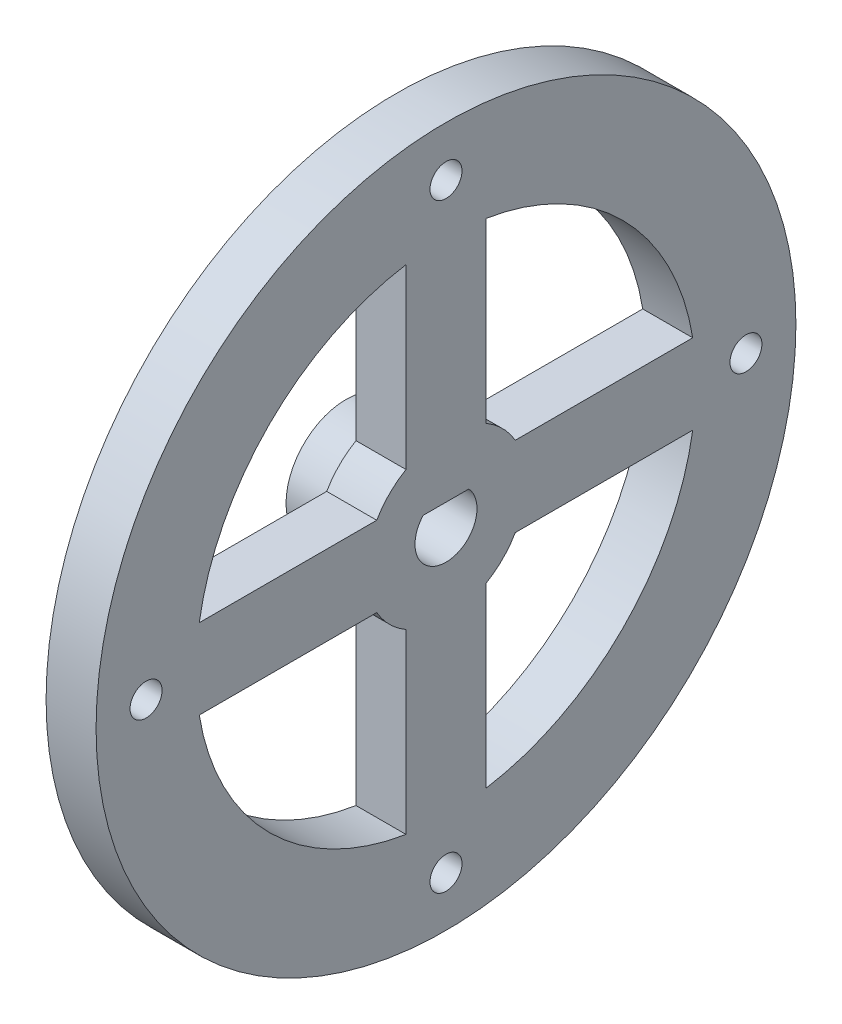
ISO-10303-21;
HEADER;
FILE_DESCRIPTION(('STEP AP214'),'2;1');
FILE_NAME('part.step','',(''),(''),'','','');
FILE_SCHEMA(('AUTOMOTIVE_DESIGN { 1 0 10303 214 1 1 1 1 }'));
ENDSEC;
DATA;
#1=APPLICATION_CONTEXT('core data for automotive mechanical design processes');
#2=APPLICATION_PROTOCOL_DEFINITION('international standard','automotive_design',2000,#1);
#3=PRODUCT_CONTEXT('',#1,'mechanical');
#4=PRODUCT('Part','Part','',(#3));
#5=PRODUCT_RELATED_PRODUCT_CATEGORY('part','',(#4));
#6=PRODUCT_DEFINITION_FORMATION('','',#4);
#7=PRODUCT_DEFINITION_CONTEXT('part definition',#1,'design');
#8=PRODUCT_DEFINITION('design','',#6,#7);
#9=PRODUCT_DEFINITION_SHAPE('','',#8);
#10=(LENGTH_UNIT() NAMED_UNIT(*) SI_UNIT(.MILLI.,.METRE.));
#11=(NAMED_UNIT(*) PLANE_ANGLE_UNIT() SI_UNIT($,.RADIAN.));
#12=(NAMED_UNIT(*) SI_UNIT($,.STERADIAN.) SOLID_ANGLE_UNIT());
#13=UNCERTAINTY_MEASURE_WITH_UNIT(LENGTH_MEASURE(1.E-05),#10,'distance_accuracy_value','');
#14=(GEOMETRIC_REPRESENTATION_CONTEXT(3) GLOBAL_UNCERTAINTY_ASSIGNED_CONTEXT((#13)) GLOBAL_UNIT_ASSIGNED_CONTEXT((#10,
#11,#12)) REPRESENTATION_CONTEXT('',''));
#15=CARTESIAN_POINT('',(0.,0.,0.));
#16=DIRECTION('',(0.,0.,1.));
#17=DIRECTION('',(1.,0.,0.));
#18=AXIS2_PLACEMENT_3D('',#15,#16,#17);
#19=CARTESIAN_POINT('',(5.,0.,-30.));
#20=DIRECTION('',(-1.,0.,0.));
#21=DIRECTION('',(0.,0.,1.));
#22=AXIS2_PLACEMENT_3D('',#19,#20,#21);
#23=CYLINDRICAL_SURFACE('',#22,1.6);
#24=CARTESIAN_POINT('',(5.,0.,-30.));
#25=DIRECTION('',(-1.,0.,0.));
#26=DIRECTION('',(0.,0.,1.));
#27=AXIS2_PLACEMENT_3D('',#24,#25,#26);
#28=CIRCLE('',#27,1.6);
#29=CARTESIAN_POINT('',(5.,0.,-28.4));
#30=VERTEX_POINT('',#29);
#31=EDGE_CURVE('E201',#30,#30,#28,.T.);
#32=ORIENTED_EDGE('',*,*,#31,.F.);
#33=EDGE_LOOP('',(#32));
#34=FACE_BOUND('',#33,.T.);
#35=CARTESIAN_POINT('',(2.,0.,-30.));
#36=DIRECTION('',(-1.,0.,0.));
#37=DIRECTION('',(0.,0.,1.));
#38=AXIS2_PLACEMENT_3D('',#35,#36,#37);
#39=CIRCLE('',#38,1.6);
#40=CARTESIAN_POINT('',(2.,0.,-28.4));
#41=VERTEX_POINT('',#40);
#42=EDGE_CURVE('E47',#41,#41,#39,.F.);
#43=ORIENTED_EDGE('',*,*,#42,.F.);
#44=EDGE_LOOP('',(#43));
#45=FACE_BOUND('',#44,.T.);
#46=ADVANCED_FACE('F43',(#34,#45),#23,.F.);
#47=CARTESIAN_POINT('',(5.,-30.,0.));
#48=DIRECTION('',(-1.,0.,0.));
#49=DIRECTION('',(0.,0.,1.));
#50=AXIS2_PLACEMENT_3D('',#47,#48,#49);
#51=CYLINDRICAL_SURFACE('',#50,1.6);
#52=CARTESIAN_POINT('',(5.,-30.,0.));
#53=DIRECTION('',(-1.,0.,0.));
#54=DIRECTION('',(0.,0.,1.));
#55=AXIS2_PLACEMENT_3D('',#52,#53,#54);
#56=CIRCLE('',#55,1.6);
#57=CARTESIAN_POINT('',(5.,-30.,1.60000000000001));
#58=VERTEX_POINT('',#57);
#59=EDGE_CURVE('E208',#58,#58,#56,.T.);
#60=ORIENTED_EDGE('',*,*,#59,.F.);
#61=EDGE_LOOP('',(#60));
#62=FACE_BOUND('',#61,.T.);
#63=CARTESIAN_POINT('',(2.,-30.,0.));
#64=DIRECTION('',(-1.,0.,0.));
#65=DIRECTION('',(0.,0.,1.));
#66=AXIS2_PLACEMENT_3D('',#63,#64,#65);
#67=CIRCLE('',#66,1.6);
#68=CARTESIAN_POINT('',(2.,-30.,1.60000000000001));
#69=VERTEX_POINT('',#68);
#70=EDGE_CURVE('E194',#69,#69,#67,.F.);
#71=ORIENTED_EDGE('',*,*,#70,.F.);
#72=EDGE_LOOP('',(#71));
#73=FACE_BOUND('',#72,.T.);
#74=ADVANCED_FACE('F350',(#62,#73),#51,.F.);
#75=CARTESIAN_POINT('',(5.,0.,30.));
#76=DIRECTION('',(-1.,0.,0.));
#77=DIRECTION('',(0.,0.,1.));
#78=AXIS2_PLACEMENT_3D('',#75,#76,#77);
#79=CYLINDRICAL_SURFACE('',#78,1.60000000000001);
#80=CARTESIAN_POINT('',(5.,0.,30.));
#81=DIRECTION('',(-1.,0.,0.));
#82=DIRECTION('',(0.,0.,1.));
#83=AXIS2_PLACEMENT_3D('',#80,#81,#82);
#84=CIRCLE('',#83,1.60000000000001);
#85=CARTESIAN_POINT('',(5.,0.,31.6));
#86=VERTEX_POINT('',#85);
#87=EDGE_CURVE('E205',#86,#86,#84,.T.);
#88=ORIENTED_EDGE('',*,*,#87,.F.);
#89=EDGE_LOOP('',(#88));
#90=FACE_BOUND('',#89,.T.);
#91=CARTESIAN_POINT('',(2.,0.,30.));
#92=DIRECTION('',(-1.,0.,0.));
#93=DIRECTION('',(0.,0.,1.));
#94=AXIS2_PLACEMENT_3D('',#91,#92,#93);
#95=CIRCLE('',#94,1.60000000000001);
#96=CARTESIAN_POINT('',(2.,0.,31.6));
#97=VERTEX_POINT('',#96);
#98=EDGE_CURVE('E342',#97,#97,#95,.F.);
#99=ORIENTED_EDGE('',*,*,#98,.F.);
#100=EDGE_LOOP('',(#99));
#101=FACE_BOUND('',#100,.T.);
#102=ADVANCED_FACE('F352',(#90,#101),#79,.F.);
#103=CARTESIAN_POINT('',(5.,30.,0.));
#104=DIRECTION('',(-1.,0.,0.));
#105=DIRECTION('',(0.,0.,1.));
#106=AXIS2_PLACEMENT_3D('',#103,#104,#105);
#107=CYLINDRICAL_SURFACE('',#106,1.6);
#108=CARTESIAN_POINT('',(5.,30.,0.));
#109=DIRECTION('',(-1.,0.,0.));
#110=DIRECTION('',(0.,0.,1.));
#111=AXIS2_PLACEMENT_3D('',#108,#109,#110);
#112=CIRCLE('',#111,1.6);
#113=CARTESIAN_POINT('',(5.,30.,1.6));
#114=VERTEX_POINT('',#113);
#115=EDGE_CURVE('E202',#114,#114,#112,.T.);
#116=ORIENTED_EDGE('',*,*,#115,.F.);
#117=EDGE_LOOP('',(#116));
#118=FACE_BOUND('',#117,.T.);
#119=CARTESIAN_POINT('',(2.,30.,0.));
#120=DIRECTION('',(-1.,0.,0.));
#121=DIRECTION('',(0.,0.,1.));
#122=AXIS2_PLACEMENT_3D('',#119,#120,#121);
#123=CIRCLE('',#122,1.6);
#124=CARTESIAN_POINT('',(2.,30.,1.6));
#125=VERTEX_POINT('',#124);
#126=EDGE_CURVE('E339',#125,#125,#123,.F.);
#127=ORIENTED_EDGE('',*,*,#126,.F.);
#128=EDGE_LOOP('',(#127));
#129=FACE_BOUND('',#128,.T.);
#130=ADVANCED_FACE('F359',(#118,#129),#107,.F.);
#131=CARTESIAN_POINT('',(0.,0.,0.));
#132=DIRECTION('',(1.,0.,0.));
#133=DIRECTION('',(0.,0.,-1.));
#134=AXIS2_PLACEMENT_3D('',#131,#132,#133);
#135=PLANE('',#134);
#136=CARTESIAN_POINT('',(0.,30.,0.));
#137=DIRECTION('',(-1.,0.,0.));
#138=DIRECTION('',(0.,0.,1.));
#139=AXIS2_PLACEMENT_3D('',#136,#137,#138);
#140=CIRCLE('',#139,4.);
#141=CARTESIAN_POINT('',(0.,30.,4.));
#142=VERTEX_POINT('',#141);
#143=EDGE_CURVE('E447',#142,#142,#140,.T.);
#144=ORIENTED_EDGE('',*,*,#143,.F.);
#145=EDGE_LOOP('',(#144));
#146=FACE_BOUND('',#145,.T.);
#147=CARTESIAN_POINT('',(0.,0.,30.));
#148=DIRECTION('',(-1.,0.,0.));
#149=DIRECTION('',(0.,0.,1.));
#150=AXIS2_PLACEMENT_3D('',#147,#148,#149);
#151=CIRCLE('',#150,4.00000000000001);
#152=CARTESIAN_POINT('',(0.,0.,34.));
#153=VERTEX_POINT('',#152);
#154=EDGE_CURVE('E451',#153,#153,#151,.T.);
#155=ORIENTED_EDGE('',*,*,#154,.F.);
#156=EDGE_LOOP('',(#155));
#157=FACE_BOUND('',#156,.T.);
#158=CARTESIAN_POINT('',(0.,-30.,0.));
#159=DIRECTION('',(-1.,0.,0.));
#160=DIRECTION('',(0.,0.,1.));
#161=AXIS2_PLACEMENT_3D('',#158,#159,#160);
#162=CIRCLE('',#161,4.);
#163=CARTESIAN_POINT('',(0.,-30.,4.));
#164=VERTEX_POINT('',#163);
#165=EDGE_CURVE('E455',#164,#164,#162,.T.);
#166=ORIENTED_EDGE('',*,*,#165,.F.);
#167=EDGE_LOOP('',(#166));
#168=FACE_BOUND('',#167,.T.);
#169=CARTESIAN_POINT('',(0.,0.,-30.));
#170=DIRECTION('',(-1.,0.,0.));
#171=DIRECTION('',(0.,0.,1.));
#172=AXIS2_PLACEMENT_3D('',#169,#170,#171);
#173=CIRCLE('',#172,4.);
#174=CARTESIAN_POINT('',(0.,0.,-26.));
#175=VERTEX_POINT('',#174);
#176=EDGE_CURVE('E459',#175,#175,#173,.T.);
#177=ORIENTED_EDGE('',*,*,#176,.F.);
#178=EDGE_LOOP('',(#177));
#179=FACE_BOUND('',#178,.T.);
#180=CARTESIAN_POINT('',(0.,0.,0.));
#181=DIRECTION('',(1.,0.,0.));
#182=DIRECTION('',(0.,0.,-1.));
#183=AXIS2_PLACEMENT_3D('',#180,#181,#182);
#184=CIRCLE('',#183,25.);
#185=CARTESIAN_POINT('',(0.,-24.6779253585061,-4.));
#186=VERTEX_POINT('',#185);
#187=CARTESIAN_POINT('',(0.,-4.00000000000001,-24.6779253585061));
#188=VERTEX_POINT('',#187);
#189=EDGE_CURVE('E68',#186,#188,#184,.T.);
#190=ORIENTED_EDGE('',*,*,#189,.T.);
#191=DIRECTION('',(0.,0.,1.));
#192=VECTOR('',#191,1.);
#193=CARTESIAN_POINT('',(0.,-4.,-6.92820323027551));
#194=LINE('',#193,#192);
#195=CARTESIAN_POINT('',(0.,-4.,-6.92820323027551));
#196=VERTEX_POINT('',#195);
#197=EDGE_CURVE('E224',#188,#196,#194,.T.);
#198=ORIENTED_EDGE('',*,*,#197,.T.);
#199=CARTESIAN_POINT('',(0.,0.,0.));
#200=DIRECTION('',(-1.,0.,0.));
#201=DIRECTION('',(0.,0.,-1.));
#202=AXIS2_PLACEMENT_3D('',#199,#200,#201);
#203=CIRCLE('',#202,8.);
#204=CARTESIAN_POINT('',(0.,-6.92820323027551,-4.));
#205=VERTEX_POINT('',#204);
#206=EDGE_CURVE('E227',#196,#205,#203,.T.);
#207=ORIENTED_EDGE('',*,*,#206,.T.);
#208=DIRECTION('',(0.,-1.,0.));
#209=VECTOR('',#208,1.);
#210=CARTESIAN_POINT('',(0.,-24.6779253585061,-4.));
#211=LINE('',#210,#209);
#212=EDGE_CURVE('E216',#205,#186,#211,.T.);
#213=ORIENTED_EDGE('',*,*,#212,.T.);
#214=EDGE_LOOP('',(#190,#198,#207,#213));
#215=FACE_BOUND('',#214,.T.);
#216=CARTESIAN_POINT('',(0.,0.,0.));
#217=DIRECTION('',(1.,0.,0.));
#218=DIRECTION('',(0.,0.,1.));
#219=AXIS2_PLACEMENT_3D('',#216,#217,#218);
#220=CIRCLE('',#219,25.);
#221=CARTESIAN_POINT('',(0.,24.6779253585061,4.));
#222=VERTEX_POINT('',#221);
#223=CARTESIAN_POINT('',(0.,4.,24.6779253585061));
#224=VERTEX_POINT('',#223);
#225=EDGE_CURVE('E269',#222,#224,#220,.T.);
#226=ORIENTED_EDGE('',*,*,#225,.T.);
#227=DIRECTION('',(0.,0.,-1.));
#228=VECTOR('',#227,1.);
#229=CARTESIAN_POINT('',(0.,4.,6.92820323027551));
#230=LINE('',#229,#228);
#231=CARTESIAN_POINT('',(0.,4.,6.92820323027551));
#232=VERTEX_POINT('',#231);
#233=EDGE_CURVE('E283',#224,#232,#230,.T.);
#234=ORIENTED_EDGE('',*,*,#233,.T.);
#235=CARTESIAN_POINT('',(0.,0.,0.));
#236=DIRECTION('',(-1.,0.,0.));
#237=DIRECTION('',(0.,0.,-1.));
#238=AXIS2_PLACEMENT_3D('',#235,#236,#237);
#239=CIRCLE('',#238,8.);
#240=CARTESIAN_POINT('',(0.,6.92820323027551,4.));
#241=VERTEX_POINT('',#240);
#242=EDGE_CURVE('E286',#232,#241,#239,.T.);
#243=ORIENTED_EDGE('',*,*,#242,.T.);
#244=DIRECTION('',(0.,1.,0.));
#245=VECTOR('',#244,1.);
#246=CARTESIAN_POINT('',(0.,24.6779253585061,4.));
#247=LINE('',#246,#245);
#248=EDGE_CURVE('E273',#241,#222,#247,.T.);
#249=ORIENTED_EDGE('',*,*,#248,.T.);
#250=EDGE_LOOP('',(#226,#234,#243,#249));
#251=FACE_BOUND('',#250,.T.);
#252=CARTESIAN_POINT('',(0.,0.,0.));
#253=DIRECTION('',(1.,0.,0.));
#254=DIRECTION('',(0.,0.,-1.));
#255=AXIS2_PLACEMENT_3D('',#252,#253,#254);
#256=CIRCLE('',#255,35.);
#257=CARTESIAN_POINT('',(0.,0.,-35.));
#258=VERTEX_POINT('',#257);
#259=EDGE_CURVE('E183',#258,#258,#256,.T.);
#260=ORIENTED_EDGE('',*,*,#259,.F.);
#261=EDGE_LOOP('',(#260));
#262=FACE_BOUND('',#261,.T.);
#263=CARTESIAN_POINT('',(0.,0.,0.));
#264=DIRECTION('',(-1.,0.,0.));
#265=DIRECTION('',(0.,0.,-1.));
#266=AXIS2_PLACEMENT_3D('',#263,#264,#265);
#267=CIRCLE('',#266,8.);
#268=CARTESIAN_POINT('',(0.,6.92820323027551,-4.));
#269=VERTEX_POINT('',#268);
#270=CARTESIAN_POINT('',(0.,4.,-6.92820323027551));
#271=VERTEX_POINT('',#270);
#272=EDGE_CURVE('E300',#269,#271,#267,.T.);
#273=ORIENTED_EDGE('',*,*,#272,.T.);
#274=DIRECTION('',(0.,0.,-1.));
#275=VECTOR('',#274,1.);
#276=CARTESIAN_POINT('',(0.,3.99999999999999,-24.6779253585061));
#277=LINE('',#276,#275);
#278=CARTESIAN_POINT('',(0.,3.99999999999999,-24.6779253585061));
#279=VERTEX_POINT('',#278);
#280=EDGE_CURVE('E314',#271,#279,#277,.T.);
#281=ORIENTED_EDGE('',*,*,#280,.T.);
#282=CARTESIAN_POINT('',(0.,0.,0.));
#283=DIRECTION('',(1.,0.,0.));
#284=DIRECTION('',(0.,0.,-1.));
#285=AXIS2_PLACEMENT_3D('',#282,#283,#284);
#286=CIRCLE('',#285,25.);
#287=CARTESIAN_POINT('',(0.,24.6779253585061,-4.));
#288=VERTEX_POINT('',#287);
#289=EDGE_CURVE('E317',#279,#288,#286,.T.);
#290=ORIENTED_EDGE('',*,*,#289,.T.);
#291=DIRECTION('',(0.,-1.,0.));
#292=VECTOR('',#291,1.);
#293=CARTESIAN_POINT('',(0.,6.92820323027551,-4.));
#294=LINE('',#293,#292);
#295=EDGE_CURVE('E304',#288,#269,#294,.T.);
#296=ORIENTED_EDGE('',*,*,#295,.T.);
#297=EDGE_LOOP('',(#273,#281,#290,#296));
#298=FACE_BOUND('',#297,.T.);
#299=CARTESIAN_POINT('',(0.,0.,0.));
#300=DIRECTION('',(1.,0.,0.));
#301=DIRECTION('',(0.,0.,-1.));
#302=AXIS2_PLACEMENT_3D('',#299,#300,#301);
#303=CIRCLE('',#302,25.);
#304=CARTESIAN_POINT('',(0.,-4.,24.6779253585061));
#305=VERTEX_POINT('',#304);
#306=CARTESIAN_POINT('',(0.,-24.6779253585061,4.));
#307=VERTEX_POINT('',#306);
#308=EDGE_CURVE('E238',#305,#307,#303,.T.);
#309=ORIENTED_EDGE('',*,*,#308,.T.);
#310=DIRECTION('',(0.,1.,0.));
#311=VECTOR('',#310,1.);
#312=CARTESIAN_POINT('',(0.,-6.92820323027551,4.));
#313=LINE('',#312,#311);
#314=CARTESIAN_POINT('',(0.,-6.92820323027551,4.));
#315=VERTEX_POINT('',#314);
#316=EDGE_CURVE('E252',#307,#315,#313,.T.);
#317=ORIENTED_EDGE('',*,*,#316,.T.);
#318=CARTESIAN_POINT('',(0.,0.,0.));
#319=DIRECTION('',(-1.,0.,0.));
#320=DIRECTION('',(0.,0.,-1.));
#321=AXIS2_PLACEMENT_3D('',#318,#319,#320);
#322=CIRCLE('',#321,8.);
#323=CARTESIAN_POINT('',(0.,-4.,6.92820323027551));
#324=VERTEX_POINT('',#323);
#325=EDGE_CURVE('E255',#315,#324,#322,.T.);
#326=ORIENTED_EDGE('',*,*,#325,.T.);
#327=DIRECTION('',(0.,0.,1.));
#328=VECTOR('',#327,1.);
#329=CARTESIAN_POINT('',(0.,-4.,24.6779253585061));
#330=LINE('',#329,#328);
#331=EDGE_CURVE('E242',#324,#305,#330,.T.);
#332=ORIENTED_EDGE('',*,*,#331,.T.);
#333=EDGE_LOOP('',(#309,#317,#326,#332));
#334=FACE_BOUND('',#333,.T.);
#335=CARTESIAN_POINT('',(0.,0.,0.));
#336=DIRECTION('',(1.,0.,0.));
#337=DIRECTION('',(0.,0.,-1.));
#338=AXIS2_PLACEMENT_3D('',#335,#336,#337);
#339=CIRCLE('',#338,6.);
#340=CARTESIAN_POINT('',(0.,0.,-6.));
#341=VERTEX_POINT('',#340);
#342=EDGE_CURVE('E11',#341,#341,#339,.F.);
#343=ORIENTED_EDGE('',*,*,#342,.F.);
#344=EDGE_LOOP('',(#343));
#345=FACE_BOUND('',#344,.T.);
#346=ADVANCED_FACE('F435',(#146,#157,#168,#179,#215,#251,#262,#298,#334,#345),#135,.F.);
#347=CARTESIAN_POINT('',(5.,0.,0.));
#348=DIRECTION('',(1.,0.,0.));
#349=DIRECTION('',(0.,0.,-1.));
#350=AXIS2_PLACEMENT_3D('',#347,#348,#349);
#351=PLANE('',#350);
#352=ORIENTED_EDGE('',*,*,#115,.T.);
#353=EDGE_LOOP('',(#352));
#354=FACE_BOUND('',#353,.T.);
#355=ORIENTED_EDGE('',*,*,#87,.T.);
#356=EDGE_LOOP('',(#355));
#357=FACE_BOUND('',#356,.T.);
#358=ORIENTED_EDGE('',*,*,#59,.T.);
#359=EDGE_LOOP('',(#358));
#360=FACE_BOUND('',#359,.T.);
#361=ORIENTED_EDGE('',*,*,#31,.T.);
#362=EDGE_LOOP('',(#361));
#363=FACE_BOUND('',#362,.T.);
#364=CARTESIAN_POINT('',(5.,0.,0.));
#365=DIRECTION('',(1.,0.,0.));
#366=DIRECTION('',(0.,0.,-1.));
#367=AXIS2_PLACEMENT_3D('',#364,#365,#366);
#368=CIRCLE('',#367,35.);
#369=CARTESIAN_POINT('',(5.,0.,-35.));
#370=VERTEX_POINT('',#369);
#371=EDGE_CURVE('E52',#370,#370,#368,.T.);
#372=ORIENTED_EDGE('',*,*,#371,.T.);
#373=EDGE_LOOP('',(#372));
#374=FACE_BOUND('',#373,.T.);
#375=DIRECTION('',(0.,0.,1.));
#376=VECTOR('',#375,1.);
#377=CARTESIAN_POINT('',(5.,2.1,2.28035085019828));
#378=LINE('',#377,#376);
#379=CARTESIAN_POINT('',(5.,2.1,-2.28035085019828));
#380=VERTEX_POINT('',#379);
#381=CARTESIAN_POINT('',(5.,2.1,2.28035085019828));
#382=VERTEX_POINT('',#381);
#383=EDGE_CURVE('E332',#380,#382,#378,.T.);
#384=ORIENTED_EDGE('',*,*,#383,.F.);
#385=CARTESIAN_POINT('',(5.,0.,0.));
#386=DIRECTION('',(1.,0.,0.));
#387=DIRECTION('',(0.,0.,-1.));
#388=AXIS2_PLACEMENT_3D('',#385,#386,#387);
#389=CIRCLE('',#388,3.1);
#390=EDGE_CURVE('E180',#382,#380,#389,.T.);
#391=ORIENTED_EDGE('',*,*,#390,.F.);
#392=EDGE_LOOP('',(#384,#391));
#393=FACE_BOUND('',#392,.T.);
#394=DIRECTION('',(0.,0.,-1.));
#395=VECTOR('',#394,1.);
#396=CARTESIAN_POINT('',(5.,3.99999999999999,-24.6779253585061));
#397=LINE('',#396,#395);
#398=CARTESIAN_POINT('',(5.,4.,-6.92820323027551));
#399=VERTEX_POINT('',#398);
#400=CARTESIAN_POINT('',(5.,3.99999999999999,-24.6779253585061));
#401=VERTEX_POINT('',#400);
#402=EDGE_CURVE('E303',#399,#401,#397,.T.);
#403=ORIENTED_EDGE('',*,*,#402,.F.);
#404=CARTESIAN_POINT('',(5.,0.,0.));
#405=DIRECTION('',(-1.,0.,0.));
#406=DIRECTION('',(0.,0.,-1.));
#407=AXIS2_PLACEMENT_3D('',#404,#405,#406);
#408=CIRCLE('',#407,8.);
#409=CARTESIAN_POINT('',(5.,6.92820323027551,-4.));
#410=VERTEX_POINT('',#409);
#411=EDGE_CURVE('E301',#410,#399,#408,.T.);
#412=ORIENTED_EDGE('',*,*,#411,.F.);
#413=DIRECTION('',(0.,-1.,0.));
#414=VECTOR('',#413,1.);
#415=CARTESIAN_POINT('',(5.,6.92820323027551,-4.));
#416=LINE('',#415,#414);
#417=CARTESIAN_POINT('',(5.,24.6779253585061,-4.));
#418=VERTEX_POINT('',#417);
#419=EDGE_CURVE('E309',#418,#410,#416,.T.);
#420=ORIENTED_EDGE('',*,*,#419,.F.);
#421=CARTESIAN_POINT('',(5.,0.,0.));
#422=DIRECTION('',(1.,0.,0.));
#423=DIRECTION('',(0.,0.,-1.));
#424=AXIS2_PLACEMENT_3D('',#421,#422,#423);
#425=CIRCLE('',#424,25.);
#426=EDGE_CURVE('E306',#401,#418,#425,.T.);
#427=ORIENTED_EDGE('',*,*,#426,.F.);
#428=EDGE_LOOP('',(#403,#412,#420,#427));
#429=FACE_BOUND('',#428,.T.);
#430=DIRECTION('',(0.,0.,-1.));
#431=VECTOR('',#430,1.);
#432=CARTESIAN_POINT('',(5.,4.,6.92820323027551));
#433=LINE('',#432,#431);
#434=CARTESIAN_POINT('',(5.,4.,24.6779253585061));
#435=VERTEX_POINT('',#434);
#436=CARTESIAN_POINT('',(5.,4.,6.92820323027551));
#437=VERTEX_POINT('',#436);
#438=EDGE_CURVE('E272',#435,#437,#433,.T.);
#439=ORIENTED_EDGE('',*,*,#438,.F.);
#440=CARTESIAN_POINT('',(5.,0.,0.));
#441=DIRECTION('',(1.,0.,0.));
#442=DIRECTION('',(0.,0.,1.));
#443=AXIS2_PLACEMENT_3D('',#440,#441,#442);
#444=CIRCLE('',#443,25.);
#445=CARTESIAN_POINT('',(5.,24.6779253585061,4.));
#446=VERTEX_POINT('',#445);
#447=EDGE_CURVE('E270',#446,#435,#444,.T.);
#448=ORIENTED_EDGE('',*,*,#447,.F.);
#449=DIRECTION('',(0.,1.,0.));
#450=VECTOR('',#449,1.);
#451=CARTESIAN_POINT('',(5.,24.6779253585061,4.));
#452=LINE('',#451,#450);
#453=CARTESIAN_POINT('',(5.,6.92820323027551,4.));
#454=VERTEX_POINT('',#453);
#455=EDGE_CURVE('E278',#454,#446,#452,.T.);
#456=ORIENTED_EDGE('',*,*,#455,.F.);
#457=CARTESIAN_POINT('',(5.,0.,0.));
#458=DIRECTION('',(-1.,0.,0.));
#459=DIRECTION('',(0.,0.,-1.));
#460=AXIS2_PLACEMENT_3D('',#457,#458,#459);
#461=CIRCLE('',#460,8.);
#462=EDGE_CURVE('E275',#437,#454,#461,.T.);
#463=ORIENTED_EDGE('',*,*,#462,.F.);
#464=EDGE_LOOP('',(#439,#448,#456,#463));
#465=FACE_BOUND('',#464,.T.);
#466=DIRECTION('',(0.,1.,0.));
#467=VECTOR('',#466,1.);
#468=CARTESIAN_POINT('',(5.,-6.92820323027551,4.));
#469=LINE('',#468,#467);
#470=CARTESIAN_POINT('',(5.,-24.6779253585061,4.));
#471=VERTEX_POINT('',#470);
#472=CARTESIAN_POINT('',(5.,-6.92820323027551,4.));
#473=VERTEX_POINT('',#472);
#474=EDGE_CURVE('E241',#471,#473,#469,.T.);
#475=ORIENTED_EDGE('',*,*,#474,.F.);
#476=CARTESIAN_POINT('',(5.,0.,0.));
#477=DIRECTION('',(1.,0.,0.));
#478=DIRECTION('',(0.,0.,-1.));
#479=AXIS2_PLACEMENT_3D('',#476,#477,#478);
#480=CIRCLE('',#479,25.);
#481=CARTESIAN_POINT('',(5.,-4.,24.6779253585061));
#482=VERTEX_POINT('',#481);
#483=EDGE_CURVE('E239',#482,#471,#480,.T.);
#484=ORIENTED_EDGE('',*,*,#483,.F.);
#485=DIRECTION('',(0.,0.,1.));
#486=VECTOR('',#485,1.);
#487=CARTESIAN_POINT('',(5.,-4.,24.6779253585061));
#488=LINE('',#487,#486);
#489=CARTESIAN_POINT('',(5.,-4.,6.92820323027551));
#490=VERTEX_POINT('',#489);
#491=EDGE_CURVE('E247',#490,#482,#488,.T.);
#492=ORIENTED_EDGE('',*,*,#491,.F.);
#493=CARTESIAN_POINT('',(5.,0.,0.));
#494=DIRECTION('',(-1.,0.,0.));
#495=DIRECTION('',(0.,0.,-1.));
#496=AXIS2_PLACEMENT_3D('',#493,#494,#495);
#497=CIRCLE('',#496,8.);
#498=EDGE_CURVE('E244',#473,#490,#497,.T.);
#499=ORIENTED_EDGE('',*,*,#498,.F.);
#500=EDGE_LOOP('',(#475,#484,#492,#499));
#501=FACE_BOUND('',#500,.T.);
#502=DIRECTION('',(0.,0.,1.));
#503=VECTOR('',#502,1.);
#504=CARTESIAN_POINT('',(5.,-4.,-6.92820323027551));
#505=LINE('',#504,#503);
#506=CARTESIAN_POINT('',(5.,-4.00000000000001,-24.6779253585061));
#507=VERTEX_POINT('',#506);
#508=CARTESIAN_POINT('',(5.,-4.,-6.92820323027551));
#509=VERTEX_POINT('',#508);
#510=EDGE_CURVE('E215',#507,#509,#505,.T.);
#511=ORIENTED_EDGE('',*,*,#510,.F.);
#512=CARTESIAN_POINT('',(5.,0.,0.));
#513=DIRECTION('',(1.,0.,0.));
#514=DIRECTION('',(0.,0.,-1.));
#515=AXIS2_PLACEMENT_3D('',#512,#513,#514);
#516=CIRCLE('',#515,25.);
#517=CARTESIAN_POINT('',(5.,-24.6779253585061,-4.));
#518=VERTEX_POINT('',#517);
#519=EDGE_CURVE('E213',#518,#507,#516,.T.);
#520=ORIENTED_EDGE('',*,*,#519,.F.);
#521=DIRECTION('',(0.,-1.,0.));
#522=VECTOR('',#521,1.);
#523=CARTESIAN_POINT('',(5.,-24.6779253585061,-4.));
#524=LINE('',#523,#522);
#525=CARTESIAN_POINT('',(5.,-6.92820323027551,-4.));
#526=VERTEX_POINT('',#525);
#527=EDGE_CURVE('E220',#526,#518,#524,.T.);
#528=ORIENTED_EDGE('',*,*,#527,.F.);
#529=CARTESIAN_POINT('',(5.,0.,0.));
#530=DIRECTION('',(-1.,0.,0.));
#531=DIRECTION('',(0.,0.,-1.));
#532=AXIS2_PLACEMENT_3D('',#529,#530,#531);
#533=CIRCLE('',#532,8.);
#534=EDGE_CURVE('E218',#509,#526,#533,.T.);
#535=ORIENTED_EDGE('',*,*,#534,.F.);
#536=EDGE_LOOP('',(#511,#520,#528,#535));
#537=FACE_BOUND('',#536,.T.);
#538=ADVANCED_FACE('F433',(#354,#357,#360,#363,#374,#393,#429,#465,#501,#537),#351,.T.);
#539=CARTESIAN_POINT('',(5.,0.,0.));
#540=DIRECTION('',(-1.,0.,0.));
#541=DIRECTION('',(0.,0.,1.));
#542=AXIS2_PLACEMENT_3D('',#539,#540,#541);
#543=CYLINDRICAL_SURFACE('',#542,35.);
#544=ORIENTED_EDGE('',*,*,#371,.F.);
#545=EDGE_LOOP('',(#544));
#546=FACE_BOUND('',#545,.T.);
#547=ORIENTED_EDGE('',*,*,#259,.T.);
#548=EDGE_LOOP('',(#547));
#549=FACE_BOUND('',#548,.T.);
#550=ADVANCED_FACE('F45',(#546,#549),#543,.T.);
#551=CARTESIAN_POINT('',(5.,0.,0.));
#552=DIRECTION('',(-1.,0.,0.));
#553=DIRECTION('',(0.,0.,1.));
#554=AXIS2_PLACEMENT_3D('',#551,#552,#553);
#555=CYLINDRICAL_SURFACE('',#554,3.1);
#556=DIRECTION('',(-1.,0.,0.));
#557=VECTOR('',#556,1.);
#558=CARTESIAN_POINT('',(5.,2.1,-2.28035085019828));
#559=LINE('',#558,#557);
#560=CARTESIAN_POINT('',(-5.,2.1,-2.28035085019828));
#561=VERTEX_POINT('',#560);
#562=EDGE_CURVE('E172',#380,#561,#559,.T.);
#563=ORIENTED_EDGE('',*,*,#562,.T.);
#564=CARTESIAN_POINT('',(-5.,0.,0.));
#565=DIRECTION('',(-1.,0.,0.));
#566=DIRECTION('',(0.,0.,1.));
#567=AXIS2_PLACEMENT_3D('',#564,#565,#566);
#568=CIRCLE('',#567,3.1);
#569=CARTESIAN_POINT('',(-5.,2.1,2.28035085019828));
#570=VERTEX_POINT('',#569);
#571=EDGE_CURVE('E177',#561,#570,#568,.T.);
#572=ORIENTED_EDGE('',*,*,#571,.T.);
#573=DIRECTION('',(-1.,0.,0.));
#574=VECTOR('',#573,1.);
#575=CARTESIAN_POINT('',(5.,2.1,2.28035085019828));
#576=LINE('',#575,#574);
#577=EDGE_CURVE('E184',#382,#570,#576,.T.);
#578=ORIENTED_EDGE('',*,*,#577,.F.);
#579=ORIENTED_EDGE('',*,*,#390,.T.);
#580=EDGE_LOOP('',(#563,#572,#578,#579));
#581=FACE_BOUND('',#580,.T.);
#582=ADVANCED_FACE('F174',(#581),#555,.F.);
#583=CARTESIAN_POINT('',(5.,2.1,2.28035085019828));
#584=DIRECTION('',(0.,-1.,0.));
#585=DIRECTION('',(0.,0.,-1.));
#586=AXIS2_PLACEMENT_3D('',#583,#584,#585);
#587=PLANE('',#586);
#588=ORIENTED_EDGE('',*,*,#577,.T.);
#589=DIRECTION('',(0.,0.,-1.));
#590=VECTOR('',#589,1.);
#591=CARTESIAN_POINT('',(-5.,2.1,-2.28035085019828));
#592=LINE('',#591,#590);
#593=EDGE_CURVE('E186',#570,#561,#592,.T.);
#594=ORIENTED_EDGE('',*,*,#593,.T.);
#595=ORIENTED_EDGE('',*,*,#562,.F.);
#596=ORIENTED_EDGE('',*,*,#383,.T.);
#597=EDGE_LOOP('',(#588,#594,#595,#596));
#598=FACE_BOUND('',#597,.T.);
#599=ADVANCED_FACE('F187',(#598),#587,.T.);
#600=CARTESIAN_POINT('',(5.,0.,0.));
#601=DIRECTION('',(-1.,0.,0.));
#602=DIRECTION('',(0.,0.,1.));
#603=AXIS2_PLACEMENT_3D('',#600,#601,#602);
#604=CYLINDRICAL_SURFACE('',#603,8.);
#605=ORIENTED_EDGE('',*,*,#272,.F.);
#606=DIRECTION('',(-1.,0.,0.));
#607=VECTOR('',#606,1.);
#608=CARTESIAN_POINT('',(5.,6.92820323027551,-4.));
#609=LINE('',#608,#607);
#610=EDGE_CURVE('E311',#410,#269,#609,.T.);
#611=ORIENTED_EDGE('',*,*,#610,.F.);
#612=ORIENTED_EDGE('',*,*,#411,.T.);
#613=DIRECTION('',(-1.,0.,0.));
#614=VECTOR('',#613,1.);
#615=CARTESIAN_POINT('',(5.,4.,-6.92820323027551));
#616=LINE('',#615,#614);
#617=EDGE_CURVE('E328',#399,#271,#616,.T.);
#618=ORIENTED_EDGE('',*,*,#617,.T.);
#619=EDGE_LOOP('',(#605,#611,#612,#618));
#620=FACE_BOUND('',#619,.T.);
#621=ADVANCED_FACE('F424',(#620),#604,.T.);
#622=CARTESIAN_POINT('',(5.,3.99999999999999,-24.6779253585061));
#623=DIRECTION('',(0.,1.,0.));
#624=DIRECTION('',(0.,0.,1.));
#625=AXIS2_PLACEMENT_3D('',#622,#623,#624);
#626=PLANE('',#625);
#627=ORIENTED_EDGE('',*,*,#280,.F.);
#628=ORIENTED_EDGE('',*,*,#617,.F.);
#629=ORIENTED_EDGE('',*,*,#402,.T.);
#630=DIRECTION('',(-1.,0.,0.));
#631=VECTOR('',#630,1.);
#632=CARTESIAN_POINT('',(5.,3.99999999999999,-24.6779253585061));
#633=LINE('',#632,#631);
#634=EDGE_CURVE('E326',#401,#279,#633,.T.);
#635=ORIENTED_EDGE('',*,*,#634,.T.);
#636=EDGE_LOOP('',(#627,#628,#629,#635));
#637=FACE_BOUND('',#636,.T.);
#638=ADVANCED_FACE('F420',(#637),#626,.T.);
#639=CARTESIAN_POINT('',(5.,0.,0.));
#640=DIRECTION('',(-1.,0.,0.));
#641=DIRECTION('',(0.,0.,1.));
#642=AXIS2_PLACEMENT_3D('',#639,#640,#641);
#643=CYLINDRICAL_SURFACE('',#642,25.);
#644=ORIENTED_EDGE('',*,*,#289,.F.);
#645=ORIENTED_EDGE('',*,*,#634,.F.);
#646=ORIENTED_EDGE('',*,*,#426,.T.);
#647=DIRECTION('',(-1.,0.,0.));
#648=VECTOR('',#647,1.);
#649=CARTESIAN_POINT('',(5.,24.6779253585061,-4.));
#650=LINE('',#649,#648);
#651=EDGE_CURVE('E324',#418,#288,#650,.T.);
#652=ORIENTED_EDGE('',*,*,#651,.T.);
#653=EDGE_LOOP('',(#644,#645,#646,#652));
#654=FACE_BOUND('',#653,.T.);
#655=ADVANCED_FACE('F416',(#654),#643,.F.);
#656=CARTESIAN_POINT('',(5.,6.92820323027551,-4.));
#657=DIRECTION('',(0.,0.,-1.));
#658=DIRECTION('',(0.,1.,0.));
#659=AXIS2_PLACEMENT_3D('',#656,#657,#658);
#660=PLANE('',#659);
#661=ORIENTED_EDGE('',*,*,#295,.F.);
#662=ORIENTED_EDGE('',*,*,#651,.F.);
#663=ORIENTED_EDGE('',*,*,#419,.T.);
#664=ORIENTED_EDGE('',*,*,#610,.T.);
#665=EDGE_LOOP('',(#661,#662,#663,#664));
#666=FACE_BOUND('',#665,.T.);
#667=ADVANCED_FACE('F412',(#666),#660,.T.);
#668=CARTESIAN_POINT('',(5.,0.,0.));
#669=DIRECTION('',(-1.,0.,0.));
#670=DIRECTION('',(0.,0.,1.));
#671=AXIS2_PLACEMENT_3D('',#668,#669,#670);
#672=CYLINDRICAL_SURFACE('',#671,25.);
#673=ORIENTED_EDGE('',*,*,#225,.F.);
#674=DIRECTION('',(-1.,0.,0.));
#675=VECTOR('',#674,1.);
#676=CARTESIAN_POINT('',(5.,24.6779253585061,4.));
#677=LINE('',#676,#675);
#678=EDGE_CURVE('E280',#446,#222,#677,.T.);
#679=ORIENTED_EDGE('',*,*,#678,.F.);
#680=ORIENTED_EDGE('',*,*,#447,.T.);
#681=DIRECTION('',(-1.,0.,0.));
#682=VECTOR('',#681,1.);
#683=CARTESIAN_POINT('',(5.,4.,24.6779253585061));
#684=LINE('',#683,#682);
#685=EDGE_CURVE('E297',#435,#224,#684,.T.);
#686=ORIENTED_EDGE('',*,*,#685,.T.);
#687=EDGE_LOOP('',(#673,#679,#680,#686));
#688=FACE_BOUND('',#687,.T.);
#689=ADVANCED_FACE('F408',(#688),#672,.F.);
#690=CARTESIAN_POINT('',(5.,4.,6.92820323027551));
#691=DIRECTION('',(0.,1.,0.));
#692=DIRECTION('',(0.,0.,1.));
#693=AXIS2_PLACEMENT_3D('',#690,#691,#692);
#694=PLANE('',#693);
#695=ORIENTED_EDGE('',*,*,#233,.F.);
#696=ORIENTED_EDGE('',*,*,#685,.F.);
#697=ORIENTED_EDGE('',*,*,#438,.T.);
#698=DIRECTION('',(-1.,0.,0.));
#699=VECTOR('',#698,1.);
#700=CARTESIAN_POINT('',(5.,4.,6.92820323027551));
#701=LINE('',#700,#699);
#702=EDGE_CURVE('E295',#437,#232,#701,.T.);
#703=ORIENTED_EDGE('',*,*,#702,.T.);
#704=EDGE_LOOP('',(#695,#696,#697,#703));
#705=FACE_BOUND('',#704,.T.);
#706=ADVANCED_FACE('F404',(#705),#694,.T.);
#707=CARTESIAN_POINT('',(5.,0.,0.));
#708=DIRECTION('',(-1.,0.,0.));
#709=DIRECTION('',(0.,0.,1.));
#710=AXIS2_PLACEMENT_3D('',#707,#708,#709);
#711=CYLINDRICAL_SURFACE('',#710,8.);
#712=ORIENTED_EDGE('',*,*,#242,.F.);
#713=ORIENTED_EDGE('',*,*,#702,.F.);
#714=ORIENTED_EDGE('',*,*,#462,.T.);
#715=DIRECTION('',(-1.,0.,0.));
#716=VECTOR('',#715,1.);
#717=CARTESIAN_POINT('',(5.,6.92820323027551,4.));
#718=LINE('',#717,#716);
#719=EDGE_CURVE('E293',#454,#241,#718,.T.);
#720=ORIENTED_EDGE('',*,*,#719,.T.);
#721=EDGE_LOOP('',(#712,#713,#714,#720));
#722=FACE_BOUND('',#721,.T.);
#723=ADVANCED_FACE('F400',(#722),#711,.T.);
#724=CARTESIAN_POINT('',(5.,24.6779253585061,4.));
#725=DIRECTION('',(0.,0.,1.));
#726=DIRECTION('',(0.,-1.,0.));
#727=AXIS2_PLACEMENT_3D('',#724,#725,#726);
#728=PLANE('',#727);
#729=ORIENTED_EDGE('',*,*,#248,.F.);
#730=ORIENTED_EDGE('',*,*,#719,.F.);
#731=ORIENTED_EDGE('',*,*,#455,.T.);
#732=ORIENTED_EDGE('',*,*,#678,.T.);
#733=EDGE_LOOP('',(#729,#730,#731,#732));
#734=FACE_BOUND('',#733,.T.);
#735=ADVANCED_FACE('F396',(#734),#728,.T.);
#736=CARTESIAN_POINT('',(5.,0.,0.));
#737=DIRECTION('',(-1.,0.,0.));
#738=DIRECTION('',(0.,0.,1.));
#739=AXIS2_PLACEMENT_3D('',#736,#737,#738);
#740=CYLINDRICAL_SURFACE('',#739,25.);
#741=ORIENTED_EDGE('',*,*,#308,.F.);
#742=DIRECTION('',(-1.,0.,0.));
#743=VECTOR('',#742,1.);
#744=CARTESIAN_POINT('',(5.,-4.,24.6779253585061));
#745=LINE('',#744,#743);
#746=EDGE_CURVE('E249',#482,#305,#745,.T.);
#747=ORIENTED_EDGE('',*,*,#746,.F.);
#748=ORIENTED_EDGE('',*,*,#483,.T.);
#749=DIRECTION('',(-1.,0.,0.));
#750=VECTOR('',#749,1.);
#751=CARTESIAN_POINT('',(5.,-24.6779253585061,4.));
#752=LINE('',#751,#750);
#753=EDGE_CURVE('E266',#471,#307,#752,.T.);
#754=ORIENTED_EDGE('',*,*,#753,.T.);
#755=EDGE_LOOP('',(#741,#747,#748,#754));
#756=FACE_BOUND('',#755,.T.);
#757=ADVANCED_FACE('F392',(#756),#740,.F.);
#758=CARTESIAN_POINT('',(5.,-6.92820323027551,4.));
#759=DIRECTION('',(0.,0.,1.));
#760=DIRECTION('',(0.,-1.,0.));
#761=AXIS2_PLACEMENT_3D('',#758,#759,#760);
#762=PLANE('',#761);
#763=ORIENTED_EDGE('',*,*,#316,.F.);
#764=ORIENTED_EDGE('',*,*,#753,.F.);
#765=ORIENTED_EDGE('',*,*,#474,.T.);
#766=DIRECTION('',(-1.,0.,0.));
#767=VECTOR('',#766,1.);
#768=CARTESIAN_POINT('',(5.,-6.92820323027551,4.));
#769=LINE('',#768,#767);
#770=EDGE_CURVE('E264',#473,#315,#769,.T.);
#771=ORIENTED_EDGE('',*,*,#770,.T.);
#772=EDGE_LOOP('',(#763,#764,#765,#771));
#773=FACE_BOUND('',#772,.T.);
#774=ADVANCED_FACE('F388',(#773),#762,.T.);
#775=CARTESIAN_POINT('',(5.,0.,0.));
#776=DIRECTION('',(-1.,0.,0.));
#777=DIRECTION('',(0.,0.,1.));
#778=AXIS2_PLACEMENT_3D('',#775,#776,#777);
#779=CYLINDRICAL_SURFACE('',#778,8.);
#780=ORIENTED_EDGE('',*,*,#325,.F.);
#781=ORIENTED_EDGE('',*,*,#770,.F.);
#782=ORIENTED_EDGE('',*,*,#498,.T.);
#783=DIRECTION('',(-1.,0.,0.));
#784=VECTOR('',#783,1.);
#785=CARTESIAN_POINT('',(5.,-4.,6.92820323027551));
#786=LINE('',#785,#784);
#787=EDGE_CURVE('E262',#490,#324,#786,.T.);
#788=ORIENTED_EDGE('',*,*,#787,.T.);
#789=EDGE_LOOP('',(#780,#781,#782,#788));
#790=FACE_BOUND('',#789,.T.);
#791=ADVANCED_FACE('F384',(#790),#779,.T.);
#792=CARTESIAN_POINT('',(5.,-4.,24.6779253585061));
#793=DIRECTION('',(0.,-1.,0.));
#794=DIRECTION('',(0.,0.,-1.));
#795=AXIS2_PLACEMENT_3D('',#792,#793,#794);
#796=PLANE('',#795);
#797=ORIENTED_EDGE('',*,*,#331,.F.);
#798=ORIENTED_EDGE('',*,*,#787,.F.);
#799=ORIENTED_EDGE('',*,*,#491,.T.);
#800=ORIENTED_EDGE('',*,*,#746,.T.);
#801=EDGE_LOOP('',(#797,#798,#799,#800));
#802=FACE_BOUND('',#801,.T.);
#803=ADVANCED_FACE('F381',(#802),#796,.T.);
#804=CARTESIAN_POINT('',(5.,0.,0.));
#805=DIRECTION('',(-1.,0.,0.));
#806=DIRECTION('',(0.,0.,1.));
#807=AXIS2_PLACEMENT_3D('',#804,#805,#806);
#808=CYLINDRICAL_SURFACE('',#807,25.);
#809=ORIENTED_EDGE('',*,*,#189,.F.);
#810=DIRECTION('',(-1.,0.,0.));
#811=VECTOR('',#810,1.);
#812=CARTESIAN_POINT('',(5.,-24.6779253585061,-4.));
#813=LINE('',#812,#811);
#814=EDGE_CURVE('E222',#518,#186,#813,.T.);
#815=ORIENTED_EDGE('',*,*,#814,.F.);
#816=ORIENTED_EDGE('',*,*,#519,.T.);
#817=DIRECTION('',(-1.,0.,0.));
#818=VECTOR('',#817,1.);
#819=CARTESIAN_POINT('',(5.,-4.00000000000001,-24.6779253585061));
#820=LINE('',#819,#818);
#821=EDGE_CURVE('E236',#507,#188,#820,.T.);
#822=ORIENTED_EDGE('',*,*,#821,.T.);
#823=EDGE_LOOP('',(#809,#815,#816,#822));
#824=FACE_BOUND('',#823,.T.);
#825=ADVANCED_FACE('F377',(#824),#808,.F.);
#826=CARTESIAN_POINT('',(5.,-4.,-6.92820323027551));
#827=DIRECTION('',(0.,-1.,0.));
#828=DIRECTION('',(0.,0.,-1.));
#829=AXIS2_PLACEMENT_3D('',#826,#827,#828);
#830=PLANE('',#829);
#831=ORIENTED_EDGE('',*,*,#197,.F.);
#832=ORIENTED_EDGE('',*,*,#821,.F.);
#833=ORIENTED_EDGE('',*,*,#510,.T.);
#834=DIRECTION('',(-1.,0.,0.));
#835=VECTOR('',#834,1.);
#836=CARTESIAN_POINT('',(5.,-4.,-6.92820323027551));
#837=LINE('',#836,#835);
#838=EDGE_CURVE('E234',#509,#196,#837,.T.);
#839=ORIENTED_EDGE('',*,*,#838,.T.);
#840=EDGE_LOOP('',(#831,#832,#833,#839));
#841=FACE_BOUND('',#840,.T.);
#842=ADVANCED_FACE('F373',(#841),#830,.T.);
#843=CARTESIAN_POINT('',(5.,0.,0.));
#844=DIRECTION('',(-1.,0.,0.));
#845=DIRECTION('',(0.,0.,1.));
#846=AXIS2_PLACEMENT_3D('',#843,#844,#845);
#847=CYLINDRICAL_SURFACE('',#846,8.);
#848=ORIENTED_EDGE('',*,*,#206,.F.);
#849=ORIENTED_EDGE('',*,*,#838,.F.);
#850=ORIENTED_EDGE('',*,*,#534,.T.);
#851=DIRECTION('',(-1.,0.,0.));
#852=VECTOR('',#851,1.);
#853=CARTESIAN_POINT('',(5.,-6.92820323027551,-4.));
#854=LINE('',#853,#852);
#855=EDGE_CURVE('E60',#526,#205,#854,.T.);
#856=ORIENTED_EDGE('',*,*,#855,.T.);
#857=EDGE_LOOP('',(#848,#849,#850,#856));
#858=FACE_BOUND('',#857,.T.);
#859=ADVANCED_FACE('F370',(#858),#847,.T.);
#860=CARTESIAN_POINT('',(5.,-24.6779253585061,-4.));
#861=DIRECTION('',(0.,0.,-1.));
#862=DIRECTION('',(0.,1.,0.));
#863=AXIS2_PLACEMENT_3D('',#860,#861,#862);
#864=PLANE('',#863);
#865=ORIENTED_EDGE('',*,*,#212,.F.);
#866=ORIENTED_EDGE('',*,*,#855,.F.);
#867=ORIENTED_EDGE('',*,*,#527,.T.);
#868=ORIENTED_EDGE('',*,*,#814,.T.);
#869=EDGE_LOOP('',(#865,#866,#867,#868));
#870=FACE_BOUND('',#869,.T.);
#871=ADVANCED_FACE('F367',(#870),#864,.T.);
#872=CARTESIAN_POINT('',(-5.,0.,0.));
#873=DIRECTION('',(-1.,0.,0.));
#874=DIRECTION('',(0.,0.,1.));
#875=AXIS2_PLACEMENT_3D('',#872,#873,#874);
#876=PLANE('',#875);
#877=CARTESIAN_POINT('',(-5.,0.,0.));
#878=DIRECTION('',(-1.,0.,0.));
#879=DIRECTION('',(0.,0.,1.));
#880=AXIS2_PLACEMENT_3D('',#877,#878,#879);
#881=CIRCLE('',#880,6.);
#882=CARTESIAN_POINT('',(-5.,0.,6.));
#883=VERTEX_POINT('',#882);
#884=EDGE_CURVE('E189',#883,#883,#881,.T.);
#885=ORIENTED_EDGE('',*,*,#884,.T.);
#886=EDGE_LOOP('',(#885));
#887=FACE_BOUND('',#886,.T.);
#888=ORIENTED_EDGE('',*,*,#593,.F.);
#889=ORIENTED_EDGE('',*,*,#571,.F.);
#890=EDGE_LOOP('',(#888,#889));
#891=FACE_BOUND('',#890,.T.);
#892=ADVANCED_FACE('F191',(#887,#891),#876,.T.);
#893=CARTESIAN_POINT('',(-5.,0.,0.));
#894=DIRECTION('',(1.,0.,0.));
#895=DIRECTION('',(0.,0.,-1.));
#896=AXIS2_PLACEMENT_3D('',#893,#894,#895);
#897=CYLINDRICAL_SURFACE('',#896,6.);
#898=ORIENTED_EDGE('',*,*,#884,.F.);
#899=EDGE_LOOP('',(#898));
#900=FACE_BOUND('',#899,.T.);
#901=ORIENTED_EDGE('',*,*,#342,.T.);
#902=EDGE_LOOP('',(#901));
#903=FACE_BOUND('',#902,.T.);
#904=ADVANCED_FACE('F468',(#900,#903),#897,.T.);
#905=CARTESIAN_POINT('',(2.,30.,0.));
#906=DIRECTION('',(-1.,0.,0.));
#907=DIRECTION('',(0.,0.,1.));
#908=AXIS2_PLACEMENT_3D('',#905,#906,#907);
#909=PLANE('',#908);
#910=CARTESIAN_POINT('',(2.,30.,0.));
#911=DIRECTION('',(-1.,0.,0.));
#912=DIRECTION('',(0.,0.,1.));
#913=AXIS2_PLACEMENT_3D('',#910,#911,#912);
#914=CIRCLE('',#913,4.);
#915=CARTESIAN_POINT('',(2.,30.,4.));
#916=VERTEX_POINT('',#915);
#917=EDGE_CURVE('E343',#916,#916,#914,.T.);
#918=ORIENTED_EDGE('',*,*,#917,.T.);
#919=EDGE_LOOP('',(#918));
#920=FACE_BOUND('',#919,.T.);
#921=ORIENTED_EDGE('',*,*,#126,.T.);
#922=EDGE_LOOP('',(#921));
#923=FACE_BOUND('',#922,.T.);
#924=ADVANCED_FACE('F470',(#920,#923),#909,.T.);
#925=CARTESIAN_POINT('',(2.,30.,0.));
#926=DIRECTION('',(-1.,0.,0.));
#927=DIRECTION('',(0.,0.,1.));
#928=AXIS2_PLACEMENT_3D('',#925,#926,#927);
#929=CYLINDRICAL_SURFACE('',#928,4.);
#930=ORIENTED_EDGE('',*,*,#917,.F.);
#931=EDGE_LOOP('',(#930));
#932=FACE_BOUND('',#931,.T.);
#933=ORIENTED_EDGE('',*,*,#143,.T.);
#934=EDGE_LOOP('',(#933));
#935=FACE_BOUND('',#934,.T.);
#936=ADVANCED_FACE('F476',(#932,#935),#929,.F.);
#937=CARTESIAN_POINT('',(2.,0.,30.));
#938=DIRECTION('',(-1.,0.,0.));
#939=DIRECTION('',(0.,0.,1.));
#940=AXIS2_PLACEMENT_3D('',#937,#938,#939);
#941=PLANE('',#940);
#942=CARTESIAN_POINT('',(2.,0.,30.));
#943=DIRECTION('',(-1.,0.,0.));
#944=DIRECTION('',(0.,0.,1.));
#945=AXIS2_PLACEMENT_3D('',#942,#943,#944);
#946=CIRCLE('',#945,4.00000000000001);
#947=CARTESIAN_POINT('',(2.,0.,34.));
#948=VERTEX_POINT('',#947);
#949=EDGE_CURVE('E515',#948,#948,#946,.T.);
#950=ORIENTED_EDGE('',*,*,#949,.T.);
#951=EDGE_LOOP('',(#950));
#952=FACE_BOUND('',#951,.T.);
#953=ORIENTED_EDGE('',*,*,#98,.T.);
#954=EDGE_LOOP('',(#953));
#955=FACE_BOUND('',#954,.T.);
#956=ADVANCED_FACE('F499',(#952,#955),#941,.T.);
#957=CARTESIAN_POINT('',(2.,0.,30.));
#958=DIRECTION('',(-1.,0.,0.));
#959=DIRECTION('',(0.,0.,1.));
#960=AXIS2_PLACEMENT_3D('',#957,#958,#959);
#961=CYLINDRICAL_SURFACE('',#960,4.00000000000001);
#962=ORIENTED_EDGE('',*,*,#949,.F.);
#963=EDGE_LOOP('',(#962));
#964=FACE_BOUND('',#963,.T.);
#965=ORIENTED_EDGE('',*,*,#154,.T.);
#966=EDGE_LOOP('',(#965));
#967=FACE_BOUND('',#966,.T.);
#968=ADVANCED_FACE('F494',(#964,#967),#961,.F.);
#969=CARTESIAN_POINT('',(2.,-30.,0.));
#970=DIRECTION('',(-1.,0.,0.));
#971=DIRECTION('',(0.,0.,1.));
#972=AXIS2_PLACEMENT_3D('',#969,#970,#971);
#973=PLANE('',#972);
#974=CARTESIAN_POINT('',(2.,-30.,0.));
#975=DIRECTION('',(-1.,0.,0.));
#976=DIRECTION('',(0.,0.,1.));
#977=AXIS2_PLACEMENT_3D('',#974,#975,#976);
#978=CIRCLE('',#977,4.);
#979=CARTESIAN_POINT('',(2.,-30.,4.));
#980=VERTEX_POINT('',#979);
#981=EDGE_CURVE('E521',#980,#980,#978,.T.);
#982=ORIENTED_EDGE('',*,*,#981,.T.);
#983=EDGE_LOOP('',(#982));
#984=FACE_BOUND('',#983,.T.);
#985=ORIENTED_EDGE('',*,*,#70,.T.);
#986=EDGE_LOOP('',(#985));
#987=FACE_BOUND('',#986,.T.);
#988=ADVANCED_FACE('F348',(#984,#987),#973,.T.);
#989=CARTESIAN_POINT('',(2.,-30.,0.));
#990=DIRECTION('',(-1.,0.,0.));
#991=DIRECTION('',(0.,0.,1.));
#992=AXIS2_PLACEMENT_3D('',#989,#990,#991);
#993=CYLINDRICAL_SURFACE('',#992,4.);
#994=ORIENTED_EDGE('',*,*,#981,.F.);
#995=EDGE_LOOP('',(#994));
#996=FACE_BOUND('',#995,.T.);
#997=ORIENTED_EDGE('',*,*,#165,.T.);
#998=EDGE_LOOP('',(#997));
#999=FACE_BOUND('',#998,.T.);
#1000=ADVANCED_FACE('F487',(#996,#999),#993,.F.);
#1001=CARTESIAN_POINT('',(2.,0.,-30.));
#1002=DIRECTION('',(-1.,0.,0.));
#1003=DIRECTION('',(0.,0.,1.));
#1004=AXIS2_PLACEMENT_3D('',#1001,#1002,#1003);
#1005=PLANE('',#1004);
#1006=CARTESIAN_POINT('',(2.,0.,-30.));
#1007=DIRECTION('',(-1.,0.,0.));
#1008=DIRECTION('',(0.,0.,1.));
#1009=AXIS2_PLACEMENT_3D('',#1006,#1007,#1008);
#1010=CIRCLE('',#1009,4.);
#1011=CARTESIAN_POINT('',(2.,0.,-26.));
#1012=VERTEX_POINT('',#1011);
#1013=EDGE_CURVE('E196',#1012,#1012,#1010,.T.);
#1014=ORIENTED_EDGE('',*,*,#1013,.T.);
#1015=EDGE_LOOP('',(#1014));
#1016=FACE_BOUND('',#1015,.T.);
#1017=ORIENTED_EDGE('',*,*,#42,.T.);
#1018=EDGE_LOOP('',(#1017));
#1019=FACE_BOUND('',#1018,.T.);
#1020=ADVANCED_FACE('F483',(#1016,#1019),#1005,.T.);
#1021=CARTESIAN_POINT('',(2.,0.,-30.));
#1022=DIRECTION('',(-1.,0.,0.));
#1023=DIRECTION('',(0.,0.,1.));
#1024=AXIS2_PLACEMENT_3D('',#1021,#1022,#1023);
#1025=CYLINDRICAL_SURFACE('',#1024,4.);
#1026=ORIENTED_EDGE('',*,*,#1013,.F.);
#1027=EDGE_LOOP('',(#1026));
#1028=FACE_BOUND('',#1027,.T.);
#1029=ORIENTED_EDGE('',*,*,#176,.T.);
#1030=EDGE_LOOP('',(#1029));
#1031=FACE_BOUND('',#1030,.T.);
#1032=ADVANCED_FACE('F486',(#1028,#1031),#1025,.F.);
#1033=CLOSED_SHELL('',(#46,#74,#102,#130,#346,#538,#550,#582,#599,#621,#638,#655,#667,#689,#706,
#723,#735,#757,#774,#791,#803,#825,#842,#859,#871,#892,#904,#924,#936,#956,#968,#988,#1000,
#1020,#1032));
#1034=MANIFOLD_SOLID_BREP('B2',#1033);
#1035=ADVANCED_BREP_SHAPE_REPRESENTATION('',(#18,#1034),#14);
#1036=SHAPE_DEFINITION_REPRESENTATION(#9,#1035);
ENDSEC;
END-ISO-10303-21;
